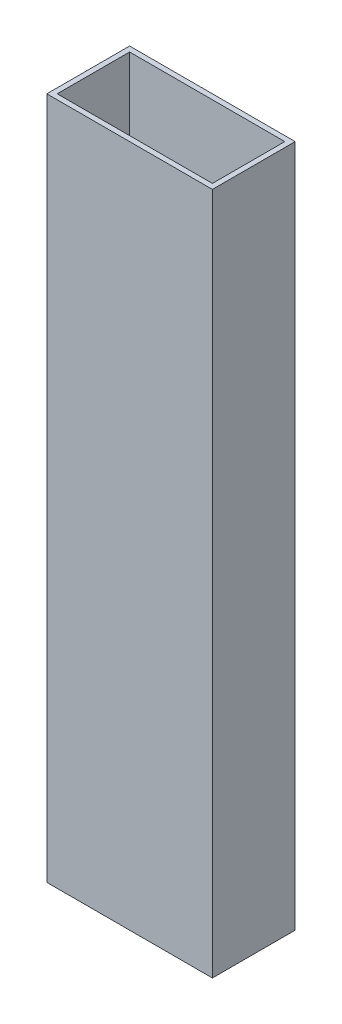
ISO-10303-21;
HEADER;
FILE_DESCRIPTION(('STEP AP214'),'2;1');
FILE_NAME('part.step','',(''),(''),'','','');
FILE_SCHEMA(('AUTOMOTIVE_DESIGN { 1 0 10303 214 1 1 1 1 }'));
ENDSEC;
DATA;
#1=APPLICATION_CONTEXT('core data for automotive mechanical design processes');
#2=APPLICATION_PROTOCOL_DEFINITION('international standard','automotive_design',2000,#1);
#3=PRODUCT_CONTEXT('',#1,'mechanical');
#4=PRODUCT('Part','Part','',(#3));
#5=PRODUCT_RELATED_PRODUCT_CATEGORY('part','',(#4));
#6=PRODUCT_DEFINITION_FORMATION('','',#4);
#7=PRODUCT_DEFINITION_CONTEXT('part definition',#1,'design');
#8=PRODUCT_DEFINITION('design','',#6,#7);
#9=PRODUCT_DEFINITION_SHAPE('','',#8);
#10=(LENGTH_UNIT() NAMED_UNIT(*) SI_UNIT(.MILLI.,.METRE.));
#11=(NAMED_UNIT(*) PLANE_ANGLE_UNIT() SI_UNIT($,.RADIAN.));
#12=(NAMED_UNIT(*) SI_UNIT($,.STERADIAN.) SOLID_ANGLE_UNIT());
#13=UNCERTAINTY_MEASURE_WITH_UNIT(LENGTH_MEASURE(1.E-05),#10,'distance_accuracy_value','');
#14=(GEOMETRIC_REPRESENTATION_CONTEXT(3) GLOBAL_UNCERTAINTY_ASSIGNED_CONTEXT((#13)) GLOBAL_UNIT_ASSIGNED_CONTEXT((#10,
#11,#12)) REPRESENTATION_CONTEXT('',''));
#15=CARTESIAN_POINT('',(0.,0.,0.));
#16=DIRECTION('',(0.,0.,1.));
#17=DIRECTION('',(1.,0.,0.));
#18=AXIS2_PLACEMENT_3D('',#15,#16,#17);
#19=CARTESIAN_POINT('',(0.,209.55,0.));
#20=DIRECTION('',(0.,1.,0.));
#21=DIRECTION('',(0.,0.,1.));
#22=AXIS2_PLACEMENT_3D('',#19,#20,#21);
#23=PLANE('',#22);
#24=DIRECTION('',(0.,0.,1.));
#25=VECTOR('',#24,1.);
#26=CARTESIAN_POINT('',(-30.1782178217822,209.55,-19.0290429042904));
#27=LINE('',#26,#25);
#28=CARTESIAN_POINT('',(-30.1782178217822,209.55,-19.0290429042904));
#29=VERTEX_POINT('',#28);
#30=CARTESIAN_POINT('',(-30.1782178217822,209.55,6.37095709570957));
#31=VERTEX_POINT('',#30);
#32=EDGE_CURVE('E153',#29,#31,#27,.T.);
#33=ORIENTED_EDGE('',*,*,#32,.T.);
#34=DIRECTION('',(1.,0.,0.));
#35=VECTOR('',#34,1.);
#36=CARTESIAN_POINT('',(-30.1782178217822,209.55,6.37095709570957));
#37=LINE('',#36,#35);
#38=CARTESIAN_POINT('',(20.6217821782178,209.55,6.37095709570957));
#39=VERTEX_POINT('',#38);
#40=EDGE_CURVE('E157',#31,#39,#37,.T.);
#41=ORIENTED_EDGE('',*,*,#40,.T.);
#42=DIRECTION('',(0.,0.,-1.));
#43=VECTOR('',#42,1.);
#44=CARTESIAN_POINT('',(20.6217821782178,209.55,-19.0290429042904));
#45=LINE('',#44,#43);
#46=CARTESIAN_POINT('',(20.6217821782178,209.55,-19.0290429042904));
#47=VERTEX_POINT('',#46);
#48=EDGE_CURVE('E161',#39,#47,#45,.T.);
#49=ORIENTED_EDGE('',*,*,#48,.T.);
#50=DIRECTION('',(-1.,0.,0.));
#51=VECTOR('',#50,1.);
#52=CARTESIAN_POINT('',(-30.1782178217822,209.55,-19.0290429042904));
#53=LINE('',#52,#51);
#54=EDGE_CURVE('E164',#47,#29,#53,.T.);
#55=ORIENTED_EDGE('',*,*,#54,.T.);
#56=EDGE_LOOP('',(#33,#41,#49,#55));
#57=FACE_BOUND('',#56,.T.);
#58=DIRECTION('',(1.,0.,0.));
#59=VECTOR('',#58,1.);
#60=CARTESIAN_POINT('',(-28.5907178217822,209.55,4.78345709570957));
#61=LINE('',#60,#59);
#62=CARTESIAN_POINT('',(-28.5907178217822,209.55,4.78345709570957));
#63=VERTEX_POINT('',#62);
#64=CARTESIAN_POINT('',(19.0342821782178,209.55,4.78345709570957));
#65=VERTEX_POINT('',#64);
#66=EDGE_CURVE('E114',#63,#65,#61,.T.);
#67=ORIENTED_EDGE('',*,*,#66,.F.);
#68=DIRECTION('',(0.,0.,1.));
#69=VECTOR('',#68,1.);
#70=CARTESIAN_POINT('',(-28.5907178217822,209.55,-17.4415429042904));
#71=LINE('',#70,#69);
#72=CARTESIAN_POINT('',(-28.5907178217822,209.55,-17.4415429042904));
#73=VERTEX_POINT('',#72);
#74=EDGE_CURVE('E105',#73,#63,#71,.T.);
#75=ORIENTED_EDGE('',*,*,#74,.F.);
#76=DIRECTION('',(-1.,0.,0.));
#77=VECTOR('',#76,1.);
#78=CARTESIAN_POINT('',(-28.5907178217822,209.55,-17.4415429042904));
#79=LINE('',#78,#77);
#80=CARTESIAN_POINT('',(19.0342821782178,209.55,-17.4415429042904));
#81=VERTEX_POINT('',#80);
#82=EDGE_CURVE('E131',#81,#73,#79,.T.);
#83=ORIENTED_EDGE('',*,*,#82,.F.);
#84=DIRECTION('',(0.,0.,-1.));
#85=VECTOR('',#84,1.);
#86=CARTESIAN_POINT('',(19.0342821782178,209.55,-17.4415429042904));
#87=LINE('',#86,#85);
#88=EDGE_CURVE('E127',#65,#81,#87,.T.);
#89=ORIENTED_EDGE('',*,*,#88,.F.);
#90=EDGE_LOOP('',(#67,#75,#83,#89));
#91=FACE_BOUND('',#90,.T.);
#92=ADVANCED_FACE('F39',(#57,#91),#23,.T.);
#93=CARTESIAN_POINT('',(0.,0.,0.));
#94=DIRECTION('',(0.,1.,0.));
#95=DIRECTION('',(0.,0.,1.));
#96=AXIS2_PLACEMENT_3D('',#93,#94,#95);
#97=PLANE('',#96);
#98=DIRECTION('',(0.,0.,1.));
#99=VECTOR('',#98,1.);
#100=CARTESIAN_POINT('',(-30.1782178217822,0.,-19.0290429042904));
#101=LINE('',#100,#99);
#102=CARTESIAN_POINT('',(-30.1782178217822,0.,-19.0290429042904));
#103=VERTEX_POINT('',#102);
#104=CARTESIAN_POINT('',(-30.1782178217822,0.,6.37095709570957));
#105=VERTEX_POINT('',#104);
#106=EDGE_CURVE('E123',#103,#105,#101,.T.);
#107=ORIENTED_EDGE('',*,*,#106,.F.);
#108=DIRECTION('',(-1.,0.,0.));
#109=VECTOR('',#108,1.);
#110=CARTESIAN_POINT('',(-30.1782178217822,0.,-19.0290429042904));
#111=LINE('',#110,#109);
#112=CARTESIAN_POINT('',(20.6217821782178,0.,-19.0290429042904));
#113=VERTEX_POINT('',#112);
#114=EDGE_CURVE('E158',#113,#103,#111,.T.);
#115=ORIENTED_EDGE('',*,*,#114,.F.);
#116=DIRECTION('',(0.,0.,-1.));
#117=VECTOR('',#116,1.);
#118=CARTESIAN_POINT('',(20.6217821782178,0.,-19.0290429042904));
#119=LINE('',#118,#117);
#120=CARTESIAN_POINT('',(20.6217821782178,0.,6.37095709570957));
#121=VERTEX_POINT('',#120);
#122=EDGE_CURVE('E174',#121,#113,#119,.T.);
#123=ORIENTED_EDGE('',*,*,#122,.F.);
#124=DIRECTION('',(1.,0.,0.));
#125=VECTOR('',#124,1.);
#126=CARTESIAN_POINT('',(-30.1782178217822,0.,6.37095709570957));
#127=LINE('',#126,#125);
#128=EDGE_CURVE('E171',#105,#121,#127,.T.);
#129=ORIENTED_EDGE('',*,*,#128,.F.);
#130=EDGE_LOOP('',(#107,#115,#123,#129));
#131=FACE_BOUND('',#130,.T.);
#132=DIRECTION('',(0.,0.,1.));
#133=VECTOR('',#132,1.);
#134=CARTESIAN_POINT('',(-28.5907178217822,0.,-17.4415429042904));
#135=LINE('',#134,#133);
#136=CARTESIAN_POINT('',(-28.5907178217822,0.,-17.4415429042904));
#137=VERTEX_POINT('',#136);
#138=CARTESIAN_POINT('',(-28.5907178217822,0.,4.78345709570957));
#139=VERTEX_POINT('',#138);
#140=EDGE_CURVE('E63',#137,#139,#135,.T.);
#141=ORIENTED_EDGE('',*,*,#140,.T.);
#142=DIRECTION('',(1.,0.,0.));
#143=VECTOR('',#142,1.);
#144=CARTESIAN_POINT('',(-28.5907178217822,0.,4.78345709570957));
#145=LINE('',#144,#143);
#146=CARTESIAN_POINT('',(19.0342821782178,0.,4.78345709570957));
#147=VERTEX_POINT('',#146);
#148=EDGE_CURVE('E121',#139,#147,#145,.T.);
#149=ORIENTED_EDGE('',*,*,#148,.T.);
#150=DIRECTION('',(0.,0.,-1.));
#151=VECTOR('',#150,1.);
#152=CARTESIAN_POINT('',(19.0342821782178,0.,-17.4415429042904));
#153=LINE('',#152,#151);
#154=CARTESIAN_POINT('',(19.0342821782178,0.,-17.4415429042904));
#155=VERTEX_POINT('',#154);
#156=EDGE_CURVE('E140',#147,#155,#153,.T.);
#157=ORIENTED_EDGE('',*,*,#156,.T.);
#158=DIRECTION('',(-1.,0.,0.));
#159=VECTOR('',#158,1.);
#160=CARTESIAN_POINT('',(-28.5907178217822,0.,-17.4415429042904));
#161=LINE('',#160,#159);
#162=EDGE_CURVE('E115',#155,#137,#161,.T.);
#163=ORIENTED_EDGE('',*,*,#162,.T.);
#164=EDGE_LOOP('',(#141,#149,#157,#163));
#165=FACE_BOUND('',#164,.T.);
#166=ADVANCED_FACE('F197',(#131,#165),#97,.F.);
#167=CARTESIAN_POINT('',(-30.1782178217822,209.55,-19.0290429042904));
#168=DIRECTION('',(1.,0.,0.));
#169=DIRECTION('',(0.,0.,-1.));
#170=AXIS2_PLACEMENT_3D('',#167,#168,#169);
#171=PLANE('',#170);
#172=ORIENTED_EDGE('',*,*,#106,.T.);
#173=DIRECTION('',(0.,-1.,0.));
#174=VECTOR('',#173,1.);
#175=CARTESIAN_POINT('',(-30.1782178217822,209.55,6.37095709570957));
#176=LINE('',#175,#174);
#177=EDGE_CURVE('E11',#31,#105,#176,.T.);
#178=ORIENTED_EDGE('',*,*,#177,.F.);
#179=ORIENTED_EDGE('',*,*,#32,.F.);
#180=DIRECTION('',(0.,-1.,0.));
#181=VECTOR('',#180,1.);
#182=CARTESIAN_POINT('',(-30.1782178217822,209.55,-19.0290429042904));
#183=LINE('',#182,#181);
#184=EDGE_CURVE('E167',#29,#103,#183,.T.);
#185=ORIENTED_EDGE('',*,*,#184,.T.);
#186=EDGE_LOOP('',(#172,#178,#179,#185));
#187=FACE_BOUND('',#186,.T.);
#188=ADVANCED_FACE('F41',(#187),#171,.F.);
#189=CARTESIAN_POINT('',(-30.1782178217822,209.55,6.37095709570957));
#190=DIRECTION('',(0.,0.,-1.));
#191=DIRECTION('',(-1.,0.,0.));
#192=AXIS2_PLACEMENT_3D('',#189,#190,#191);
#193=PLANE('',#192);
#194=ORIENTED_EDGE('',*,*,#128,.T.);
#195=DIRECTION('',(0.,-1.,0.));
#196=VECTOR('',#195,1.);
#197=CARTESIAN_POINT('',(20.6217821782178,209.55,6.37095709570957));
#198=LINE('',#197,#196);
#199=EDGE_CURVE('E48',#39,#121,#198,.T.);
#200=ORIENTED_EDGE('',*,*,#199,.F.);
#201=ORIENTED_EDGE('',*,*,#40,.F.);
#202=ORIENTED_EDGE('',*,*,#177,.T.);
#203=EDGE_LOOP('',(#194,#200,#201,#202));
#204=FACE_BOUND('',#203,.T.);
#205=ADVANCED_FACE('F207',(#204),#193,.F.);
#206=CARTESIAN_POINT('',(20.6217821782178,209.55,-19.0290429042904));
#207=DIRECTION('',(-1.,0.,0.));
#208=DIRECTION('',(0.,0.,1.));
#209=AXIS2_PLACEMENT_3D('',#206,#207,#208);
#210=PLANE('',#209);
#211=ORIENTED_EDGE('',*,*,#122,.T.);
#212=DIRECTION('',(0.,-1.,0.));
#213=VECTOR('',#212,1.);
#214=CARTESIAN_POINT('',(20.6217821782178,209.55,-19.0290429042904));
#215=LINE('',#214,#213);
#216=EDGE_CURVE('E182',#47,#113,#215,.T.);
#217=ORIENTED_EDGE('',*,*,#216,.F.);
#218=ORIENTED_EDGE('',*,*,#48,.F.);
#219=ORIENTED_EDGE('',*,*,#199,.T.);
#220=EDGE_LOOP('',(#211,#217,#218,#219));
#221=FACE_BOUND('',#220,.T.);
#222=ADVANCED_FACE('F191',(#221),#210,.F.);
#223=CARTESIAN_POINT('',(-30.1782178217822,209.55,-19.0290429042904));
#224=DIRECTION('',(0.,0.,1.));
#225=DIRECTION('',(1.,0.,0.));
#226=AXIS2_PLACEMENT_3D('',#223,#224,#225);
#227=PLANE('',#226);
#228=ORIENTED_EDGE('',*,*,#114,.T.);
#229=ORIENTED_EDGE('',*,*,#184,.F.);
#230=ORIENTED_EDGE('',*,*,#54,.F.);
#231=ORIENTED_EDGE('',*,*,#216,.T.);
#232=EDGE_LOOP('',(#228,#229,#230,#231));
#233=FACE_BOUND('',#232,.T.);
#234=ADVANCED_FACE('F201',(#233),#227,.F.);
#235=CARTESIAN_POINT('',(-28.5907178217822,209.55,-17.4415429042904));
#236=DIRECTION('',(1.,0.,0.));
#237=DIRECTION('',(0.,0.,-1.));
#238=AXIS2_PLACEMENT_3D('',#235,#236,#237);
#239=PLANE('',#238);
#240=ORIENTED_EDGE('',*,*,#140,.F.);
#241=DIRECTION('',(0.,-1.,0.));
#242=VECTOR('',#241,1.);
#243=CARTESIAN_POINT('',(-28.5907178217822,209.55,-17.4415429042904));
#244=LINE('',#243,#242);
#245=EDGE_CURVE('E109',#73,#137,#244,.T.);
#246=ORIENTED_EDGE('',*,*,#245,.F.);
#247=ORIENTED_EDGE('',*,*,#74,.T.);
#248=DIRECTION('',(0.,-1.,0.));
#249=VECTOR('',#248,1.);
#250=CARTESIAN_POINT('',(-28.5907178217822,209.55,4.78345709570957));
#251=LINE('',#250,#249);
#252=EDGE_CURVE('E108',#63,#139,#251,.T.);
#253=ORIENTED_EDGE('',*,*,#252,.T.);
#254=EDGE_LOOP('',(#240,#246,#247,#253));
#255=FACE_BOUND('',#254,.T.);
#256=ADVANCED_FACE('F107',(#255),#239,.T.);
#257=CARTESIAN_POINT('',(-28.5907178217822,209.55,4.78345709570957));
#258=DIRECTION('',(0.,0.,-1.));
#259=DIRECTION('',(-1.,0.,0.));
#260=AXIS2_PLACEMENT_3D('',#257,#258,#259);
#261=PLANE('',#260);
#262=ORIENTED_EDGE('',*,*,#148,.F.);
#263=ORIENTED_EDGE('',*,*,#252,.F.);
#264=ORIENTED_EDGE('',*,*,#66,.T.);
#265=DIRECTION('',(0.,-1.,0.));
#266=VECTOR('',#265,1.);
#267=CARTESIAN_POINT('',(19.0342821782178,209.55,4.78345709570957));
#268=LINE('',#267,#266);
#269=EDGE_CURVE('E124',#65,#147,#268,.T.);
#270=ORIENTED_EDGE('',*,*,#269,.T.);
#271=EDGE_LOOP('',(#262,#263,#264,#270));
#272=FACE_BOUND('',#271,.T.);
#273=ADVANCED_FACE('F118',(#272),#261,.T.);
#274=CARTESIAN_POINT('',(19.0342821782178,209.55,-17.4415429042904));
#275=DIRECTION('',(-1.,0.,0.));
#276=DIRECTION('',(0.,0.,1.));
#277=AXIS2_PLACEMENT_3D('',#274,#275,#276);
#278=PLANE('',#277);
#279=ORIENTED_EDGE('',*,*,#156,.F.);
#280=ORIENTED_EDGE('',*,*,#269,.F.);
#281=ORIENTED_EDGE('',*,*,#88,.T.);
#282=DIRECTION('',(0.,-1.,0.));
#283=VECTOR('',#282,1.);
#284=CARTESIAN_POINT('',(19.0342821782178,209.55,-17.4415429042904));
#285=LINE('',#284,#283);
#286=EDGE_CURVE('E55',#81,#155,#285,.T.);
#287=ORIENTED_EDGE('',*,*,#286,.T.);
#288=EDGE_LOOP('',(#279,#280,#281,#287));
#289=FACE_BOUND('',#288,.T.);
#290=ADVANCED_FACE('F230',(#289),#278,.T.);
#291=CARTESIAN_POINT('',(-28.5907178217822,209.55,-17.4415429042904));
#292=DIRECTION('',(0.,0.,1.));
#293=DIRECTION('',(1.,0.,0.));
#294=AXIS2_PLACEMENT_3D('',#291,#292,#293);
#295=PLANE('',#294);
#296=ORIENTED_EDGE('',*,*,#162,.F.);
#297=ORIENTED_EDGE('',*,*,#286,.F.);
#298=ORIENTED_EDGE('',*,*,#82,.T.);
#299=ORIENTED_EDGE('',*,*,#245,.T.);
#300=EDGE_LOOP('',(#296,#297,#298,#299));
#301=FACE_BOUND('',#300,.T.);
#302=ADVANCED_FACE('F234',(#301),#295,.T.);
#303=CLOSED_SHELL('',(#92,#166,#188,#205,#222,#234,#256,#273,#290,#302));
#304=MANIFOLD_SOLID_BREP('B2',#303);
#305=ADVANCED_BREP_SHAPE_REPRESENTATION('',(#18,#304),#14);
#306=SHAPE_DEFINITION_REPRESENTATION(#9,#305);
ENDSEC;
END-ISO-10303-21;
